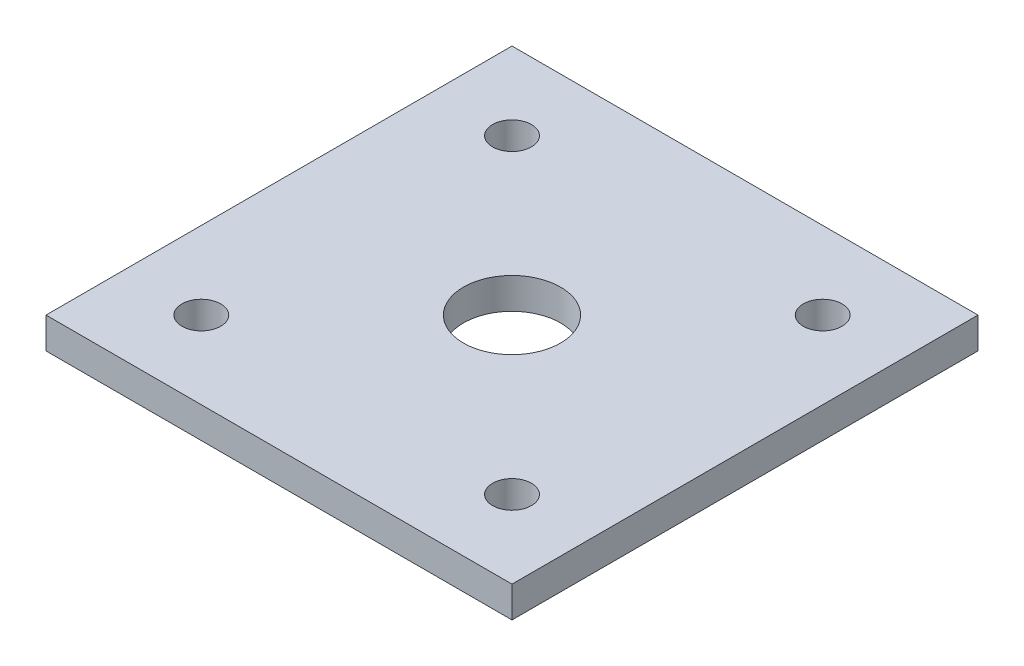
ISO-10303-21;
HEADER;
FILE_DESCRIPTION(('STEP AP214'),'2;1');
FILE_NAME('part.step','',(''),(''),'','','');
FILE_SCHEMA(('AUTOMOTIVE_DESIGN { 1 0 10303 214 1 1 1 1 }'));
ENDSEC;
DATA;
#1=APPLICATION_CONTEXT('core data for automotive mechanical design processes');
#2=APPLICATION_PROTOCOL_DEFINITION('international standard','automotive_design',2000,#1);
#3=PRODUCT_CONTEXT('',#1,'mechanical');
#4=PRODUCT('Part','Part','',(#3));
#5=PRODUCT_RELATED_PRODUCT_CATEGORY('part','',(#4));
#6=PRODUCT_DEFINITION_FORMATION('','',#4);
#7=PRODUCT_DEFINITION_CONTEXT('part definition',#1,'design');
#8=PRODUCT_DEFINITION('design','',#6,#7);
#9=PRODUCT_DEFINITION_SHAPE('','',#8);
#10=(LENGTH_UNIT() NAMED_UNIT(*) SI_UNIT(.MILLI.,.METRE.));
#11=(NAMED_UNIT(*) PLANE_ANGLE_UNIT() SI_UNIT($,.RADIAN.));
#12=(NAMED_UNIT(*) SI_UNIT($,.STERADIAN.) SOLID_ANGLE_UNIT());
#13=UNCERTAINTY_MEASURE_WITH_UNIT(LENGTH_MEASURE(1.E-05),#10,'distance_accuracy_value','');
#14=(GEOMETRIC_REPRESENTATION_CONTEXT(3) GLOBAL_UNCERTAINTY_ASSIGNED_CONTEXT((#13)) GLOBAL_UNIT_ASSIGNED_CONTEXT((#10,
#11,#12)) REPRESENTATION_CONTEXT('',''));
#15=CARTESIAN_POINT('',(0.,0.,0.));
#16=DIRECTION('',(0.,0.,1.));
#17=DIRECTION('',(1.,0.,0.));
#18=AXIS2_PLACEMENT_3D('',#15,#16,#17);
#19=CARTESIAN_POINT('',(40.,0.,40.));
#20=DIRECTION('',(0.,1.,0.));
#21=DIRECTION('',(0.,0.,1.));
#22=AXIS2_PLACEMENT_3D('',#19,#20,#21);
#23=CYLINDRICAL_SURFACE('',#22,5.);
#24=CARTESIAN_POINT('',(40.,0.,40.));
#25=DIRECTION('',(0.,1.,0.));
#26=DIRECTION('',(0.,0.,1.));
#27=AXIS2_PLACEMENT_3D('',#24,#25,#26);
#28=CIRCLE('',#27,5.);
#29=CARTESIAN_POINT('',(40.,0.,45.));
#30=VERTEX_POINT('',#29);
#31=EDGE_CURVE('E50',#30,#30,#28,.T.);
#32=ORIENTED_EDGE('',*,*,#31,.F.);
#33=EDGE_LOOP('',(#32));
#34=FACE_BOUND('',#33,.T.);
#35=CARTESIAN_POINT('',(40.,8.,40.));
#36=DIRECTION('',(0.,1.,0.));
#37=DIRECTION('',(0.,0.,1.));
#38=AXIS2_PLACEMENT_3D('',#35,#36,#37);
#39=CIRCLE('',#38,5.);
#40=CARTESIAN_POINT('',(40.,8.,45.));
#41=VERTEX_POINT('',#40);
#42=EDGE_CURVE('E11',#41,#41,#39,.T.);
#43=ORIENTED_EDGE('',*,*,#42,.T.);
#44=EDGE_LOOP('',(#43));
#45=FACE_BOUND('',#44,.T.);
#46=ADVANCED_FACE('F41',(#34,#45),#23,.F.);
#47=CARTESIAN_POINT('',(40.,0.,-40.));
#48=DIRECTION('',(0.,1.,0.));
#49=DIRECTION('',(0.,0.,1.));
#50=AXIS2_PLACEMENT_3D('',#47,#48,#49);
#51=CYLINDRICAL_SURFACE('',#50,5.);
#52=CARTESIAN_POINT('',(40.,0.,-40.));
#53=DIRECTION('',(0.,1.,0.));
#54=DIRECTION('',(0.,0.,1.));
#55=AXIS2_PLACEMENT_3D('',#52,#53,#54);
#56=CIRCLE('',#55,5.);
#57=CARTESIAN_POINT('',(40.,0.,-35.));
#58=VERTEX_POINT('',#57);
#59=EDGE_CURVE('E131',#58,#58,#56,.T.);
#60=ORIENTED_EDGE('',*,*,#59,.F.);
#61=EDGE_LOOP('',(#60));
#62=FACE_BOUND('',#61,.T.);
#63=CARTESIAN_POINT('',(40.,8.,-40.));
#64=DIRECTION('',(0.,1.,0.));
#65=DIRECTION('',(0.,0.,1.));
#66=AXIS2_PLACEMENT_3D('',#63,#64,#65);
#67=CIRCLE('',#66,5.);
#68=CARTESIAN_POINT('',(40.,8.,-35.));
#69=VERTEX_POINT('',#68);
#70=EDGE_CURVE('E135',#69,#69,#67,.T.);
#71=ORIENTED_EDGE('',*,*,#70,.T.);
#72=EDGE_LOOP('',(#71));
#73=FACE_BOUND('',#72,.T.);
#74=ADVANCED_FACE('F146',(#62,#73),#51,.F.);
#75=CARTESIAN_POINT('',(-60.,8.,60.));
#76=DIRECTION('',(1.,0.,0.));
#77=DIRECTION('',(0.,0.,-1.));
#78=AXIS2_PLACEMENT_3D('',#75,#76,#77);
#79=PLANE('',#78);
#80=DIRECTION('',(0.,0.,1.));
#81=VECTOR('',#80,1.);
#82=CARTESIAN_POINT('',(-60.,0.,60.));
#83=LINE('',#82,#81);
#84=CARTESIAN_POINT('',(-60.,0.,-60.));
#85=VERTEX_POINT('',#84);
#86=CARTESIAN_POINT('',(-60.,0.,60.));
#87=VERTEX_POINT('',#86);
#88=EDGE_CURVE('E114',#85,#87,#83,.T.);
#89=ORIENTED_EDGE('',*,*,#88,.T.);
#90=DIRECTION('',(0.,-1.,0.));
#91=VECTOR('',#90,1.);
#92=CARTESIAN_POINT('',(-60.,8.,60.));
#93=LINE('',#92,#91);
#94=CARTESIAN_POINT('',(-60.,8.,60.));
#95=VERTEX_POINT('',#94);
#96=EDGE_CURVE('E103',#95,#87,#93,.T.);
#97=ORIENTED_EDGE('',*,*,#96,.F.);
#98=DIRECTION('',(0.,0.,1.));
#99=VECTOR('',#98,1.);
#100=CARTESIAN_POINT('',(-60.,8.,60.));
#101=LINE('',#100,#99);
#102=CARTESIAN_POINT('',(-60.,8.,-60.));
#103=VERTEX_POINT('',#102);
#104=EDGE_CURVE('E95',#103,#95,#101,.T.);
#105=ORIENTED_EDGE('',*,*,#104,.F.);
#106=DIRECTION('',(0.,-1.,0.));
#107=VECTOR('',#106,1.);
#108=CARTESIAN_POINT('',(-60.,8.,-60.));
#109=LINE('',#108,#107);
#110=EDGE_CURVE('E110',#103,#85,#109,.T.);
#111=ORIENTED_EDGE('',*,*,#110,.T.);
#112=EDGE_LOOP('',(#89,#97,#105,#111));
#113=FACE_BOUND('',#112,.T.);
#114=ADVANCED_FACE('F170',(#113),#79,.F.);
#115=CARTESIAN_POINT('',(60.,8.,60.));
#116=DIRECTION('',(0.,0.,-1.));
#117=DIRECTION('',(-1.,0.,0.));
#118=AXIS2_PLACEMENT_3D('',#115,#116,#117);
#119=PLANE('',#118);
#120=DIRECTION('',(1.,0.,0.));
#121=VECTOR('',#120,1.);
#122=CARTESIAN_POINT('',(60.,0.,60.));
#123=LINE('',#122,#121);
#124=CARTESIAN_POINT('',(60.,0.,60.));
#125=VERTEX_POINT('',#124);
#126=EDGE_CURVE('E101',#87,#125,#123,.T.);
#127=ORIENTED_EDGE('',*,*,#126,.T.);
#128=DIRECTION('',(0.,-1.,0.));
#129=VECTOR('',#128,1.);
#130=CARTESIAN_POINT('',(60.,8.,60.));
#131=LINE('',#130,#129);
#132=CARTESIAN_POINT('',(60.,8.,60.));
#133=VERTEX_POINT('',#132);
#134=EDGE_CURVE('E99',#133,#125,#131,.T.);
#135=ORIENTED_EDGE('',*,*,#134,.F.);
#136=DIRECTION('',(1.,0.,0.));
#137=VECTOR('',#136,1.);
#138=CARTESIAN_POINT('',(60.,8.,60.));
#139=LINE('',#138,#137);
#140=EDGE_CURVE('E89',#95,#133,#139,.T.);
#141=ORIENTED_EDGE('',*,*,#140,.F.);
#142=ORIENTED_EDGE('',*,*,#96,.T.);
#143=EDGE_LOOP('',(#127,#135,#141,#142));
#144=FACE_BOUND('',#143,.T.);
#145=ADVANCED_FACE('F100',(#144),#119,.F.);
#146=CARTESIAN_POINT('',(60.,8.,60.));
#147=DIRECTION('',(-1.,0.,0.));
#148=DIRECTION('',(0.,0.,1.));
#149=AXIS2_PLACEMENT_3D('',#146,#147,#148);
#150=PLANE('',#149);
#151=DIRECTION('',(0.,0.,-1.));
#152=VECTOR('',#151,1.);
#153=CARTESIAN_POINT('',(60.,0.,60.));
#154=LINE('',#153,#152);
#155=CARTESIAN_POINT('',(60.,0.,-60.));
#156=VERTEX_POINT('',#155);
#157=EDGE_CURVE('E75',#125,#156,#154,.T.);
#158=ORIENTED_EDGE('',*,*,#157,.T.);
#159=DIRECTION('',(0.,-1.,0.));
#160=VECTOR('',#159,1.);
#161=CARTESIAN_POINT('',(60.,8.,-60.));
#162=LINE('',#161,#160);
#163=CARTESIAN_POINT('',(60.,8.,-60.));
#164=VERTEX_POINT('',#163);
#165=EDGE_CURVE('E104',#164,#156,#162,.T.);
#166=ORIENTED_EDGE('',*,*,#165,.F.);
#167=DIRECTION('',(0.,0.,-1.));
#168=VECTOR('',#167,1.);
#169=CARTESIAN_POINT('',(60.,8.,60.));
#170=LINE('',#169,#168);
#171=EDGE_CURVE('E93',#133,#164,#170,.T.);
#172=ORIENTED_EDGE('',*,*,#171,.F.);
#173=ORIENTED_EDGE('',*,*,#134,.T.);
#174=EDGE_LOOP('',(#158,#166,#172,#173));
#175=FACE_BOUND('',#174,.T.);
#176=ADVANCED_FACE('F106',(#175),#150,.F.);
#177=CARTESIAN_POINT('',(60.,8.,-60.));
#178=DIRECTION('',(0.,0.,1.));
#179=DIRECTION('',(1.,0.,0.));
#180=AXIS2_PLACEMENT_3D('',#177,#178,#179);
#181=PLANE('',#180);
#182=DIRECTION('',(-1.,0.,0.));
#183=VECTOR('',#182,1.);
#184=CARTESIAN_POINT('',(60.,0.,-60.));
#185=LINE('',#184,#183);
#186=EDGE_CURVE('E81',#156,#85,#185,.T.);
#187=ORIENTED_EDGE('',*,*,#186,.T.);
#188=ORIENTED_EDGE('',*,*,#110,.F.);
#189=DIRECTION('',(-1.,0.,0.));
#190=VECTOR('',#189,1.);
#191=CARTESIAN_POINT('',(60.,8.,-60.));
#192=LINE('',#191,#190);
#193=EDGE_CURVE('E58',#164,#103,#192,.T.);
#194=ORIENTED_EDGE('',*,*,#193,.F.);
#195=ORIENTED_EDGE('',*,*,#165,.T.);
#196=EDGE_LOOP('',(#187,#188,#194,#195));
#197=FACE_BOUND('',#196,.T.);
#198=ADVANCED_FACE('F150',(#197),#181,.F.);
#199=CARTESIAN_POINT('',(0.,8.,0.));
#200=DIRECTION('',(0.,1.,0.));
#201=DIRECTION('',(0.,0.,1.));
#202=AXIS2_PLACEMENT_3D('',#199,#200,#201);
#203=PLANE('',#202);
#204=CARTESIAN_POINT('',(-40.,8.,40.));
#205=DIRECTION('',(0.,1.,0.));
#206=DIRECTION('',(0.,0.,1.));
#207=AXIS2_PLACEMENT_3D('',#204,#205,#206);
#208=CIRCLE('',#207,5.);
#209=CARTESIAN_POINT('',(-40.,8.,45.));
#210=VERTEX_POINT('',#209);
#211=EDGE_CURVE('E251',#210,#210,#208,.T.);
#212=ORIENTED_EDGE('',*,*,#211,.F.);
#213=EDGE_LOOP('',(#212));
#214=FACE_BOUND('',#213,.T.);
#215=CARTESIAN_POINT('',(-40.,8.,-40.));
#216=DIRECTION('',(0.,1.,0.));
#217=DIRECTION('',(0.,0.,1.));
#218=AXIS2_PLACEMENT_3D('',#215,#216,#217);
#219=CIRCLE('',#218,5.);
#220=CARTESIAN_POINT('',(-40.,8.,-35.));
#221=VERTEX_POINT('',#220);
#222=EDGE_CURVE('E253',#221,#221,#219,.T.);
#223=ORIENTED_EDGE('',*,*,#222,.F.);
#224=EDGE_LOOP('',(#223));
#225=FACE_BOUND('',#224,.T.);
#226=CARTESIAN_POINT('',(0.,8.,0.));
#227=DIRECTION('',(0.,1.,0.));
#228=DIRECTION('',(0.,0.,1.));
#229=AXIS2_PLACEMENT_3D('',#226,#227,#228);
#230=CIRCLE('',#229,12.5);
#231=CARTESIAN_POINT('',(0.,8.,12.5));
#232=VERTEX_POINT('',#231);
#233=EDGE_CURVE('E264',#232,#232,#230,.T.);
#234=ORIENTED_EDGE('',*,*,#233,.F.);
#235=EDGE_LOOP('',(#234));
#236=FACE_BOUND('',#235,.T.);
#237=ORIENTED_EDGE('',*,*,#104,.T.);
#238=ORIENTED_EDGE('',*,*,#140,.T.);
#239=ORIENTED_EDGE('',*,*,#171,.T.);
#240=ORIENTED_EDGE('',*,*,#193,.T.);
#241=EDGE_LOOP('',(#237,#238,#239,#240));
#242=FACE_BOUND('',#241,.T.);
#243=ORIENTED_EDGE('',*,*,#70,.F.);
#244=EDGE_LOOP('',(#243));
#245=FACE_BOUND('',#244,.T.);
#246=ORIENTED_EDGE('',*,*,#42,.F.);
#247=EDGE_LOOP('',(#246));
#248=FACE_BOUND('',#247,.T.);
#249=ADVANCED_FACE('F90',(#214,#225,#236,#242,#245,#248),#203,.T.);
#250=CARTESIAN_POINT('',(0.,0.,0.));
#251=DIRECTION('',(0.,1.,0.));
#252=DIRECTION('',(0.,0.,1.));
#253=AXIS2_PLACEMENT_3D('',#250,#251,#252);
#254=PLANE('',#253);
#255=CARTESIAN_POINT('',(-40.,0.,40.));
#256=DIRECTION('',(0.,1.,0.));
#257=DIRECTION('',(0.,0.,1.));
#258=AXIS2_PLACEMENT_3D('',#255,#256,#257);
#259=CIRCLE('',#258,5.);
#260=CARTESIAN_POINT('',(-40.,0.,45.));
#261=VERTEX_POINT('',#260);
#262=EDGE_CURVE('E249',#261,#261,#259,.T.);
#263=ORIENTED_EDGE('',*,*,#262,.T.);
#264=EDGE_LOOP('',(#263));
#265=FACE_BOUND('',#264,.T.);
#266=CARTESIAN_POINT('',(-40.,0.,-40.));
#267=DIRECTION('',(0.,1.,0.));
#268=DIRECTION('',(0.,0.,1.));
#269=AXIS2_PLACEMENT_3D('',#266,#267,#268);
#270=CIRCLE('',#269,5.);
#271=CARTESIAN_POINT('',(-40.,0.,-35.));
#272=VERTEX_POINT('',#271);
#273=EDGE_CURVE('E258',#272,#272,#270,.T.);
#274=ORIENTED_EDGE('',*,*,#273,.T.);
#275=EDGE_LOOP('',(#274));
#276=FACE_BOUND('',#275,.T.);
#277=CARTESIAN_POINT('',(0.,0.,0.));
#278=DIRECTION('',(0.,1.,0.));
#279=DIRECTION('',(0.,0.,1.));
#280=AXIS2_PLACEMENT_3D('',#277,#278,#279);
#281=CIRCLE('',#280,12.5);
#282=CARTESIAN_POINT('',(0.,0.,12.5));
#283=VERTEX_POINT('',#282);
#284=EDGE_CURVE('E118',#283,#283,#281,.T.);
#285=ORIENTED_EDGE('',*,*,#284,.T.);
#286=EDGE_LOOP('',(#285));
#287=FACE_BOUND('',#286,.T.);
#288=ORIENTED_EDGE('',*,*,#88,.F.);
#289=ORIENTED_EDGE('',*,*,#186,.F.);
#290=ORIENTED_EDGE('',*,*,#157,.F.);
#291=ORIENTED_EDGE('',*,*,#126,.F.);
#292=EDGE_LOOP('',(#288,#289,#290,#291));
#293=FACE_BOUND('',#292,.T.);
#294=ORIENTED_EDGE('',*,*,#59,.T.);
#295=EDGE_LOOP('',(#294));
#296=FACE_BOUND('',#295,.T.);
#297=ORIENTED_EDGE('',*,*,#31,.T.);
#298=EDGE_LOOP('',(#297));
#299=FACE_BOUND('',#298,.T.);
#300=ADVANCED_FACE('F142',(#265,#276,#287,#293,#296,#299),#254,.F.);
#301=CARTESIAN_POINT('',(0.,0.,0.));
#302=DIRECTION('',(0.,1.,0.));
#303=DIRECTION('',(0.,0.,1.));
#304=AXIS2_PLACEMENT_3D('',#301,#302,#303);
#305=CYLINDRICAL_SURFACE('',#304,12.5);
#306=ORIENTED_EDGE('',*,*,#284,.F.);
#307=EDGE_LOOP('',(#306));
#308=FACE_BOUND('',#307,.T.);
#309=ORIENTED_EDGE('',*,*,#233,.T.);
#310=EDGE_LOOP('',(#309));
#311=FACE_BOUND('',#310,.T.);
#312=ADVANCED_FACE('F157',(#308,#311),#305,.F.);
#313=CARTESIAN_POINT('',(-40.,0.,-40.));
#314=DIRECTION('',(0.,1.,0.));
#315=DIRECTION('',(0.,0.,1.));
#316=AXIS2_PLACEMENT_3D('',#313,#314,#315);
#317=CYLINDRICAL_SURFACE('',#316,5.);
#318=ORIENTED_EDGE('',*,*,#273,.F.);
#319=EDGE_LOOP('',(#318));
#320=FACE_BOUND('',#319,.T.);
#321=ORIENTED_EDGE('',*,*,#222,.T.);
#322=EDGE_LOOP('',(#321));
#323=FACE_BOUND('',#322,.T.);
#324=ADVANCED_FACE('F209',(#320,#323),#317,.F.);
#325=CARTESIAN_POINT('',(-40.,0.,40.));
#326=DIRECTION('',(0.,1.,0.));
#327=DIRECTION('',(0.,0.,1.));
#328=AXIS2_PLACEMENT_3D('',#325,#326,#327);
#329=CYLINDRICAL_SURFACE('',#328,5.);
#330=ORIENTED_EDGE('',*,*,#262,.F.);
#331=EDGE_LOOP('',(#330));
#332=FACE_BOUND('',#331,.T.);
#333=ORIENTED_EDGE('',*,*,#211,.T.);
#334=EDGE_LOOP('',(#333));
#335=FACE_BOUND('',#334,.T.);
#336=ADVANCED_FACE('F218',(#332,#335),#329,.F.);
#337=CLOSED_SHELL('',(#46,#74,#114,#145,#176,#198,#249,#300,#312,#324,#336));
#338=MANIFOLD_SOLID_BREP('B2',#337);
#339=ADVANCED_BREP_SHAPE_REPRESENTATION('',(#18,#338),#14);
#340=SHAPE_DEFINITION_REPRESENTATION(#9,#339);
ENDSEC;
END-ISO-10303-21;
